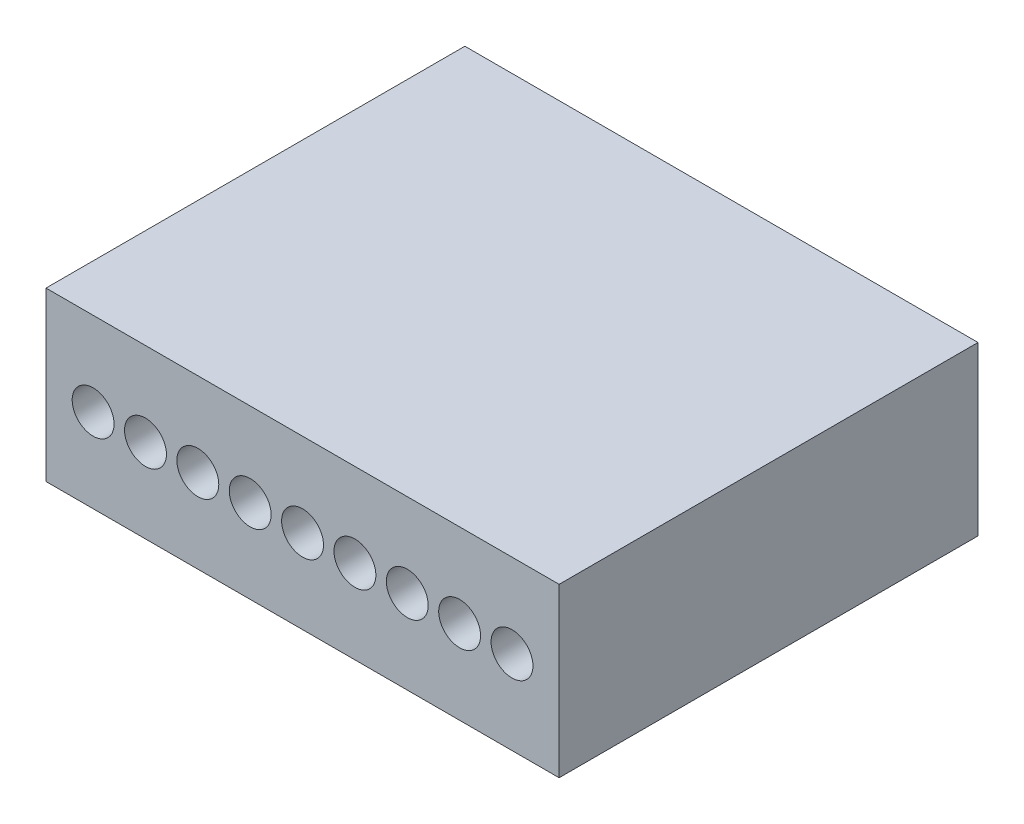
ISO-10303-21;
HEADER;
FILE_DESCRIPTION(('STEP AP214'),'2;1');
FILE_NAME('part.step','',(''),(''),'','','');
FILE_SCHEMA(('AUTOMOTIVE_DESIGN { 1 0 10303 214 1 1 1 1 }'));
ENDSEC;
DATA;
#1=APPLICATION_CONTEXT('core data for automotive mechanical design processes');
#2=APPLICATION_PROTOCOL_DEFINITION('international standard','automotive_design',2000,#1);
#3=PRODUCT_CONTEXT('',#1,'mechanical');
#4=PRODUCT('Part','Part','',(#3));
#5=PRODUCT_RELATED_PRODUCT_CATEGORY('part','',(#4));
#6=PRODUCT_DEFINITION_FORMATION('','',#4);
#7=PRODUCT_DEFINITION_CONTEXT('part definition',#1,'design');
#8=PRODUCT_DEFINITION('design','',#6,#7);
#9=PRODUCT_DEFINITION_SHAPE('','',#8);
#10=(LENGTH_UNIT() NAMED_UNIT(*) SI_UNIT(.MILLI.,.METRE.));
#11=(NAMED_UNIT(*) PLANE_ANGLE_UNIT() SI_UNIT($,.RADIAN.));
#12=(NAMED_UNIT(*) SI_UNIT($,.STERADIAN.) SOLID_ANGLE_UNIT());
#13=UNCERTAINTY_MEASURE_WITH_UNIT(LENGTH_MEASURE(1.E-05),#10,'distance_accuracy_value','');
#14=(GEOMETRIC_REPRESENTATION_CONTEXT(3) GLOBAL_UNCERTAINTY_ASSIGNED_CONTEXT((#13)) GLOBAL_UNIT_ASSIGNED_CONTEXT((#10,
#11,#12)) REPRESENTATION_CONTEXT('',''));
#15=CARTESIAN_POINT('',(0.,0.,0.));
#16=DIRECTION('',(0.,0.,1.));
#17=DIRECTION('',(1.,0.,0.));
#18=AXIS2_PLACEMENT_3D('',#15,#16,#17);
#19=CARTESIAN_POINT('',(0.,0.,10.));
#20=DIRECTION('',(1.,0.,0.));
#21=DIRECTION('',(0.,0.,-1.));
#22=AXIS2_PLACEMENT_3D('',#19,#20,#21);
#23=PLANE('',#22);
#24=DIRECTION('',(0.,-1.,0.));
#25=VECTOR('',#24,1.);
#26=CARTESIAN_POINT('',(0.,0.,0.));
#27=LINE('',#26,#25);
#28=CARTESIAN_POINT('',(0.,4.,0.));
#29=VERTEX_POINT('',#28);
#30=CARTESIAN_POINT('',(0.,0.,0.));
#31=VERTEX_POINT('',#30);
#32=EDGE_CURVE('E107',#29,#31,#27,.T.);
#33=ORIENTED_EDGE('',*,*,#32,.T.);
#34=DIRECTION('',(0.,0.,-1.));
#35=VECTOR('',#34,1.);
#36=CARTESIAN_POINT('',(0.,0.,10.));
#37=LINE('',#36,#35);
#38=CARTESIAN_POINT('',(0.,0.,10.));
#39=VERTEX_POINT('',#38);
#40=EDGE_CURVE('E11',#39,#31,#37,.T.);
#41=ORIENTED_EDGE('',*,*,#40,.F.);
#42=DIRECTION('',(0.,-1.,0.));
#43=VECTOR('',#42,1.);
#44=CARTESIAN_POINT('',(0.,0.,10.));
#45=LINE('',#44,#43);
#46=CARTESIAN_POINT('',(0.,4.,10.));
#47=VERTEX_POINT('',#46);
#48=EDGE_CURVE('E91',#47,#39,#45,.T.);
#49=ORIENTED_EDGE('',*,*,#48,.F.);
#50=DIRECTION('',(0.,0.,-1.));
#51=VECTOR('',#50,1.);
#52=CARTESIAN_POINT('',(0.,4.,10.));
#53=LINE('',#52,#51);
#54=EDGE_CURVE('E103',#47,#29,#53,.T.);
#55=ORIENTED_EDGE('',*,*,#54,.T.);
#56=EDGE_LOOP('',(#33,#41,#49,#55));
#57=FACE_BOUND('',#56,.T.);
#58=ADVANCED_FACE('F39',(#57),#23,.F.);
#59=CARTESIAN_POINT('',(0.,0.,10.));
#60=DIRECTION('',(0.,1.,0.));
#61=DIRECTION('',(0.,0.,1.));
#62=AXIS2_PLACEMENT_3D('',#59,#60,#61);
#63=PLANE('',#62);
#64=DIRECTION('',(1.,0.,0.));
#65=VECTOR('',#64,1.);
#66=CARTESIAN_POINT('',(0.,0.,0.));
#67=LINE('',#66,#65);
#68=CARTESIAN_POINT('',(12.25,0.,0.));
#69=VERTEX_POINT('',#68);
#70=EDGE_CURVE('E96',#31,#69,#67,.T.);
#71=ORIENTED_EDGE('',*,*,#70,.T.);
#72=DIRECTION('',(0.,0.,-1.));
#73=VECTOR('',#72,1.);
#74=CARTESIAN_POINT('',(12.25,0.,10.));
#75=LINE('',#74,#73);
#76=CARTESIAN_POINT('',(12.25,0.,10.));
#77=VERTEX_POINT('',#76);
#78=EDGE_CURVE('E48',#77,#69,#75,.T.);
#79=ORIENTED_EDGE('',*,*,#78,.F.);
#80=DIRECTION('',(1.,0.,0.));
#81=VECTOR('',#80,1.);
#82=CARTESIAN_POINT('',(0.,0.,10.));
#83=LINE('',#82,#81);
#84=EDGE_CURVE('E86',#39,#77,#83,.T.);
#85=ORIENTED_EDGE('',*,*,#84,.F.);
#86=ORIENTED_EDGE('',*,*,#40,.T.);
#87=EDGE_LOOP('',(#71,#79,#85,#86));
#88=FACE_BOUND('',#87,.T.);
#89=ADVANCED_FACE('F95',(#88),#63,.F.);
#90=CARTESIAN_POINT('',(12.25,0.,10.));
#91=DIRECTION('',(-1.,0.,0.));
#92=DIRECTION('',(0.,0.,1.));
#93=AXIS2_PLACEMENT_3D('',#90,#91,#92);
#94=PLANE('',#93);
#95=DIRECTION('',(0.,1.,0.));
#96=VECTOR('',#95,1.);
#97=CARTESIAN_POINT('',(12.25,0.,0.));
#98=LINE('',#97,#96);
#99=CARTESIAN_POINT('',(12.25,4.,0.));
#100=VERTEX_POINT('',#99);
#101=EDGE_CURVE('E73',#69,#100,#98,.T.);
#102=ORIENTED_EDGE('',*,*,#101,.T.);
#103=DIRECTION('',(0.,0.,-1.));
#104=VECTOR('',#103,1.);
#105=CARTESIAN_POINT('',(12.25,4.,10.));
#106=LINE('',#105,#104);
#107=CARTESIAN_POINT('',(12.25,4.,10.));
#108=VERTEX_POINT('',#107);
#109=EDGE_CURVE('E98',#108,#100,#106,.T.);
#110=ORIENTED_EDGE('',*,*,#109,.F.);
#111=DIRECTION('',(0.,1.,0.));
#112=VECTOR('',#111,1.);
#113=CARTESIAN_POINT('',(12.25,0.,10.));
#114=LINE('',#113,#112);
#115=EDGE_CURVE('E89',#77,#108,#114,.T.);
#116=ORIENTED_EDGE('',*,*,#115,.F.);
#117=ORIENTED_EDGE('',*,*,#78,.T.);
#118=EDGE_LOOP('',(#102,#110,#116,#117));
#119=FACE_BOUND('',#118,.T.);
#120=ADVANCED_FACE('F99',(#119),#94,.F.);
#121=CARTESIAN_POINT('',(0.,4.,10.));
#122=DIRECTION('',(0.,-1.,0.));
#123=DIRECTION('',(0.,0.,-1.));
#124=AXIS2_PLACEMENT_3D('',#121,#122,#123);
#125=PLANE('',#124);
#126=DIRECTION('',(-1.,0.,0.));
#127=VECTOR('',#126,1.);
#128=CARTESIAN_POINT('',(0.,4.,0.));
#129=LINE('',#128,#127);
#130=EDGE_CURVE('E79',#100,#29,#129,.T.);
#131=ORIENTED_EDGE('',*,*,#130,.T.);
#132=ORIENTED_EDGE('',*,*,#54,.F.);
#133=DIRECTION('',(-1.,0.,0.));
#134=VECTOR('',#133,1.);
#135=CARTESIAN_POINT('',(0.,4.,10.));
#136=LINE('',#135,#134);
#137=EDGE_CURVE('E56',#108,#47,#136,.T.);
#138=ORIENTED_EDGE('',*,*,#137,.F.);
#139=ORIENTED_EDGE('',*,*,#109,.T.);
#140=EDGE_LOOP('',(#131,#132,#138,#139));
#141=FACE_BOUND('',#140,.T.);
#142=ADVANCED_FACE('F121',(#141),#125,.F.);
#143=CARTESIAN_POINT('',(0.,0.,10.));
#144=DIRECTION('',(0.,0.,-1.));
#145=DIRECTION('',(-1.,0.,0.));
#146=AXIS2_PLACEMENT_3D('',#143,#144,#145);
#147=PLANE('',#146);
#148=CARTESIAN_POINT('',(1.125,2.,10.));
#149=DIRECTION('',(0.,0.,1.));
#150=DIRECTION('',(1.,0.,0.));
#151=AXIS2_PLACEMENT_3D('',#148,#149,#150);
#152=CIRCLE('',#151,0.5);
#153=CARTESIAN_POINT('',(1.625,2.,10.));
#154=VERTEX_POINT('',#153);
#155=EDGE_CURVE('E192',#154,#154,#152,.T.);
#156=ORIENTED_EDGE('',*,*,#155,.F.);
#157=EDGE_LOOP('',(#156));
#158=FACE_BOUND('',#157,.T.);
#159=CARTESIAN_POINT('',(2.375,2.,10.));
#160=DIRECTION('',(0.,0.,1.));
#161=DIRECTION('',(1.,0.,0.));
#162=AXIS2_PLACEMENT_3D('',#159,#160,#161);
#163=CIRCLE('',#162,0.5);
#164=CARTESIAN_POINT('',(2.875,2.,10.));
#165=VERTEX_POINT('',#164);
#166=EDGE_CURVE('E184',#165,#165,#163,.T.);
#167=ORIENTED_EDGE('',*,*,#166,.F.);
#168=EDGE_LOOP('',(#167));
#169=FACE_BOUND('',#168,.T.);
#170=CARTESIAN_POINT('',(3.625,2.,10.));
#171=DIRECTION('',(0.,0.,1.));
#172=DIRECTION('',(1.,0.,0.));
#173=AXIS2_PLACEMENT_3D('',#170,#171,#172);
#174=CIRCLE('',#173,0.5);
#175=CARTESIAN_POINT('',(4.125,2.,10.));
#176=VERTEX_POINT('',#175);
#177=EDGE_CURVE('E176',#176,#176,#174,.T.);
#178=ORIENTED_EDGE('',*,*,#177,.F.);
#179=EDGE_LOOP('',(#178));
#180=FACE_BOUND('',#179,.T.);
#181=CARTESIAN_POINT('',(4.875,2.,10.));
#182=DIRECTION('',(0.,0.,1.));
#183=DIRECTION('',(1.,0.,0.));
#184=AXIS2_PLACEMENT_3D('',#181,#182,#183);
#185=CIRCLE('',#184,0.5);
#186=CARTESIAN_POINT('',(5.375,2.,10.));
#187=VERTEX_POINT('',#186);
#188=EDGE_CURVE('E168',#187,#187,#185,.T.);
#189=ORIENTED_EDGE('',*,*,#188,.F.);
#190=EDGE_LOOP('',(#189));
#191=FACE_BOUND('',#190,.T.);
#192=CARTESIAN_POINT('',(6.125,2.,10.));
#193=DIRECTION('',(0.,0.,1.));
#194=DIRECTION('',(1.,0.,0.));
#195=AXIS2_PLACEMENT_3D('',#192,#193,#194);
#196=CIRCLE('',#195,0.5);
#197=CARTESIAN_POINT('',(6.625,2.,10.));
#198=VERTEX_POINT('',#197);
#199=EDGE_CURVE('E160',#198,#198,#196,.T.);
#200=ORIENTED_EDGE('',*,*,#199,.F.);
#201=EDGE_LOOP('',(#200));
#202=FACE_BOUND('',#201,.T.);
#203=CARTESIAN_POINT('',(7.375,2.,10.));
#204=DIRECTION('',(0.,0.,1.));
#205=DIRECTION('',(1.,0.,0.));
#206=AXIS2_PLACEMENT_3D('',#203,#204,#205);
#207=CIRCLE('',#206,0.500000000000002);
#208=CARTESIAN_POINT('',(7.875,2.,10.));
#209=VERTEX_POINT('',#208);
#210=EDGE_CURVE('E152',#209,#209,#207,.T.);
#211=ORIENTED_EDGE('',*,*,#210,.F.);
#212=EDGE_LOOP('',(#211));
#213=FACE_BOUND('',#212,.T.);
#214=CARTESIAN_POINT('',(8.625,2.,10.));
#215=DIRECTION('',(0.,0.,1.));
#216=DIRECTION('',(1.,0.,0.));
#217=AXIS2_PLACEMENT_3D('',#214,#215,#216);
#218=CIRCLE('',#217,0.499999999999999);
#219=CARTESIAN_POINT('',(9.125,2.,10.));
#220=VERTEX_POINT('',#219);
#221=EDGE_CURVE('E144',#220,#220,#218,.T.);
#222=ORIENTED_EDGE('',*,*,#221,.F.);
#223=EDGE_LOOP('',(#222));
#224=FACE_BOUND('',#223,.T.);
#225=CARTESIAN_POINT('',(9.875,2.,10.));
#226=DIRECTION('',(0.,0.,1.));
#227=DIRECTION('',(1.,0.,0.));
#228=AXIS2_PLACEMENT_3D('',#225,#226,#227);
#229=CIRCLE('',#228,0.499999999999999);
#230=CARTESIAN_POINT('',(10.375,2.,10.));
#231=VERTEX_POINT('',#230);
#232=EDGE_CURVE('E136',#231,#231,#229,.T.);
#233=ORIENTED_EDGE('',*,*,#232,.F.);
#234=EDGE_LOOP('',(#233));
#235=FACE_BOUND('',#234,.T.);
#236=CARTESIAN_POINT('',(11.125,2.,10.));
#237=DIRECTION('',(0.,0.,1.));
#238=DIRECTION('',(1.,0.,0.));
#239=AXIS2_PLACEMENT_3D('',#236,#237,#238);
#240=CIRCLE('',#239,0.499999999999999);
#241=CARTESIAN_POINT('',(11.625,2.,10.));
#242=VERTEX_POINT('',#241);
#243=EDGE_CURVE('E128',#242,#242,#240,.T.);
#244=ORIENTED_EDGE('',*,*,#243,.F.);
#245=EDGE_LOOP('',(#244));
#246=FACE_BOUND('',#245,.T.);
#247=ORIENTED_EDGE('',*,*,#48,.T.);
#248=ORIENTED_EDGE('',*,*,#84,.T.);
#249=ORIENTED_EDGE('',*,*,#115,.T.);
#250=ORIENTED_EDGE('',*,*,#137,.T.);
#251=EDGE_LOOP('',(#247,#248,#249,#250));
#252=FACE_BOUND('',#251,.T.);
#253=ADVANCED_FACE('F87',(#158,#169,#180,#191,#202,#213,#224,#235,#246,#252),#147,.F.);
#254=CARTESIAN_POINT('',(0.,0.,0.));
#255=DIRECTION('',(0.,0.,-1.));
#256=DIRECTION('',(-1.,0.,0.));
#257=AXIS2_PLACEMENT_3D('',#254,#255,#256);
#258=PLANE('',#257);
#259=ORIENTED_EDGE('',*,*,#32,.F.);
#260=ORIENTED_EDGE('',*,*,#130,.F.);
#261=ORIENTED_EDGE('',*,*,#101,.F.);
#262=ORIENTED_EDGE('',*,*,#70,.F.);
#263=EDGE_LOOP('',(#259,#260,#261,#262));
#264=FACE_BOUND('',#263,.T.);
#265=ADVANCED_FACE('F124',(#264),#258,.T.);
#266=CARTESIAN_POINT('',(11.125,2.,5.));
#267=DIRECTION('',(0.,0.,1.));
#268=DIRECTION('',(1.,0.,0.));
#269=AXIS2_PLACEMENT_3D('',#266,#267,#268);
#270=CYLINDRICAL_SURFACE('',#269,0.499999999999999);
#271=CARTESIAN_POINT('',(11.125,2.,5.));
#272=DIRECTION('',(0.,0.,1.));
#273=DIRECTION('',(1.,0.,0.));
#274=AXIS2_PLACEMENT_3D('',#271,#272,#273);
#275=CIRCLE('',#274,0.499999999999999);
#276=CARTESIAN_POINT('',(11.625,2.,5.));
#277=VERTEX_POINT('',#276);
#278=EDGE_CURVE('E132',#277,#277,#275,.T.);
#279=ORIENTED_EDGE('',*,*,#278,.F.);
#280=EDGE_LOOP('',(#279));
#281=FACE_BOUND('',#280,.T.);
#282=ORIENTED_EDGE('',*,*,#243,.T.);
#283=EDGE_LOOP('',(#282));
#284=FACE_BOUND('',#283,.T.);
#285=ADVANCED_FACE('F228',(#281,#284),#270,.F.);
#286=CARTESIAN_POINT('',(11.125,2.,5.));
#287=DIRECTION('',(0.,0.,1.));
#288=DIRECTION('',(1.,0.,0.));
#289=AXIS2_PLACEMENT_3D('',#286,#287,#288);
#290=PLANE('',#289);
#291=ORIENTED_EDGE('',*,*,#278,.T.);
#292=EDGE_LOOP('',(#291));
#293=FACE_BOUND('',#292,.T.);
#294=ADVANCED_FACE('F230',(#293),#290,.T.);
#295=CARTESIAN_POINT('',(9.875,2.,5.));
#296=DIRECTION('',(0.,0.,1.));
#297=DIRECTION('',(1.,0.,0.));
#298=AXIS2_PLACEMENT_3D('',#295,#296,#297);
#299=CYLINDRICAL_SURFACE('',#298,0.499999999999999);
#300=CARTESIAN_POINT('',(9.875,2.,5.));
#301=DIRECTION('',(0.,0.,1.));
#302=DIRECTION('',(1.,0.,0.));
#303=AXIS2_PLACEMENT_3D('',#300,#301,#302);
#304=CIRCLE('',#303,0.499999999999999);
#305=CARTESIAN_POINT('',(10.375,2.,5.));
#306=VERTEX_POINT('',#305);
#307=EDGE_CURVE('E140',#306,#306,#304,.T.);
#308=ORIENTED_EDGE('',*,*,#307,.F.);
#309=EDGE_LOOP('',(#308));
#310=FACE_BOUND('',#309,.T.);
#311=ORIENTED_EDGE('',*,*,#232,.T.);
#312=EDGE_LOOP('',(#311));
#313=FACE_BOUND('',#312,.T.);
#314=ADVANCED_FACE('F237',(#310,#313),#299,.F.);
#315=CARTESIAN_POINT('',(9.875,2.,5.));
#316=DIRECTION('',(0.,0.,1.));
#317=DIRECTION('',(1.,0.,0.));
#318=AXIS2_PLACEMENT_3D('',#315,#316,#317);
#319=PLANE('',#318);
#320=ORIENTED_EDGE('',*,*,#307,.T.);
#321=EDGE_LOOP('',(#320));
#322=FACE_BOUND('',#321,.T.);
#323=ADVANCED_FACE('F285',(#322),#319,.T.);
#324=CARTESIAN_POINT('',(8.625,2.,5.));
#325=DIRECTION('',(0.,0.,1.));
#326=DIRECTION('',(1.,0.,0.));
#327=AXIS2_PLACEMENT_3D('',#324,#325,#326);
#328=CYLINDRICAL_SURFACE('',#327,0.499999999999999);
#329=CARTESIAN_POINT('',(8.625,2.,5.));
#330=DIRECTION('',(0.,0.,1.));
#331=DIRECTION('',(1.,0.,0.));
#332=AXIS2_PLACEMENT_3D('',#329,#330,#331);
#333=CIRCLE('',#332,0.499999999999999);
#334=CARTESIAN_POINT('',(9.125,2.,5.));
#335=VERTEX_POINT('',#334);
#336=EDGE_CURVE('E148',#335,#335,#333,.T.);
#337=ORIENTED_EDGE('',*,*,#336,.F.);
#338=EDGE_LOOP('',(#337));
#339=FACE_BOUND('',#338,.T.);
#340=ORIENTED_EDGE('',*,*,#221,.T.);
#341=EDGE_LOOP('',(#340));
#342=FACE_BOUND('',#341,.T.);
#343=ADVANCED_FACE('F294',(#339,#342),#328,.F.);
#344=CARTESIAN_POINT('',(8.625,2.,5.));
#345=DIRECTION('',(0.,0.,1.));
#346=DIRECTION('',(1.,0.,0.));
#347=AXIS2_PLACEMENT_3D('',#344,#345,#346);
#348=PLANE('',#347);
#349=ORIENTED_EDGE('',*,*,#336,.T.);
#350=EDGE_LOOP('',(#349));
#351=FACE_BOUND('',#350,.T.);
#352=ADVANCED_FACE('F303',(#351),#348,.T.);
#353=CARTESIAN_POINT('',(7.375,2.,5.));
#354=DIRECTION('',(0.,0.,1.));
#355=DIRECTION('',(1.,0.,0.));
#356=AXIS2_PLACEMENT_3D('',#353,#354,#355);
#357=CYLINDRICAL_SURFACE('',#356,0.500000000000002);
#358=CARTESIAN_POINT('',(7.375,2.,5.));
#359=DIRECTION('',(0.,0.,1.));
#360=DIRECTION('',(1.,0.,0.));
#361=AXIS2_PLACEMENT_3D('',#358,#359,#360);
#362=CIRCLE('',#361,0.500000000000002);
#363=CARTESIAN_POINT('',(7.875,2.,5.));
#364=VERTEX_POINT('',#363);
#365=EDGE_CURVE('E156',#364,#364,#362,.T.);
#366=ORIENTED_EDGE('',*,*,#365,.F.);
#367=EDGE_LOOP('',(#366));
#368=FACE_BOUND('',#367,.T.);
#369=ORIENTED_EDGE('',*,*,#210,.T.);
#370=EDGE_LOOP('',(#369));
#371=FACE_BOUND('',#370,.T.);
#372=ADVANCED_FACE('F312',(#368,#371),#357,.F.);
#373=CARTESIAN_POINT('',(7.375,2.,5.));
#374=DIRECTION('',(0.,0.,1.));
#375=DIRECTION('',(1.,0.,0.));
#376=AXIS2_PLACEMENT_3D('',#373,#374,#375);
#377=PLANE('',#376);
#378=ORIENTED_EDGE('',*,*,#365,.T.);
#379=EDGE_LOOP('',(#378));
#380=FACE_BOUND('',#379,.T.);
#381=ADVANCED_FACE('F321',(#380),#377,.T.);
#382=CARTESIAN_POINT('',(6.125,2.,5.));
#383=DIRECTION('',(0.,0.,1.));
#384=DIRECTION('',(1.,0.,0.));
#385=AXIS2_PLACEMENT_3D('',#382,#383,#384);
#386=CYLINDRICAL_SURFACE('',#385,0.5);
#387=CARTESIAN_POINT('',(6.125,2.,5.));
#388=DIRECTION('',(0.,0.,1.));
#389=DIRECTION('',(1.,0.,0.));
#390=AXIS2_PLACEMENT_3D('',#387,#388,#389);
#391=CIRCLE('',#390,0.5);
#392=CARTESIAN_POINT('',(6.625,2.,5.));
#393=VERTEX_POINT('',#392);
#394=EDGE_CURVE('E164',#393,#393,#391,.T.);
#395=ORIENTED_EDGE('',*,*,#394,.F.);
#396=EDGE_LOOP('',(#395));
#397=FACE_BOUND('',#396,.T.);
#398=ORIENTED_EDGE('',*,*,#199,.T.);
#399=EDGE_LOOP('',(#398));
#400=FACE_BOUND('',#399,.T.);
#401=ADVANCED_FACE('F330',(#397,#400),#386,.F.);
#402=CARTESIAN_POINT('',(6.125,2.,5.));
#403=DIRECTION('',(0.,0.,1.));
#404=DIRECTION('',(1.,0.,0.));
#405=AXIS2_PLACEMENT_3D('',#402,#403,#404);
#406=PLANE('',#405);
#407=ORIENTED_EDGE('',*,*,#394,.T.);
#408=EDGE_LOOP('',(#407));
#409=FACE_BOUND('',#408,.T.);
#410=ADVANCED_FACE('F339',(#409),#406,.T.);
#411=CARTESIAN_POINT('',(4.875,2.,5.));
#412=DIRECTION('',(0.,0.,1.));
#413=DIRECTION('',(1.,0.,0.));
#414=AXIS2_PLACEMENT_3D('',#411,#412,#413);
#415=CYLINDRICAL_SURFACE('',#414,0.5);
#416=CARTESIAN_POINT('',(4.875,2.,5.));
#417=DIRECTION('',(0.,0.,1.));
#418=DIRECTION('',(1.,0.,0.));
#419=AXIS2_PLACEMENT_3D('',#416,#417,#418);
#420=CIRCLE('',#419,0.5);
#421=CARTESIAN_POINT('',(5.375,2.,5.));
#422=VERTEX_POINT('',#421);
#423=EDGE_CURVE('E172',#422,#422,#420,.T.);
#424=ORIENTED_EDGE('',*,*,#423,.F.);
#425=EDGE_LOOP('',(#424));
#426=FACE_BOUND('',#425,.T.);
#427=ORIENTED_EDGE('',*,*,#188,.T.);
#428=EDGE_LOOP('',(#427));
#429=FACE_BOUND('',#428,.T.);
#430=ADVANCED_FACE('F348',(#426,#429),#415,.F.);
#431=CARTESIAN_POINT('',(4.875,2.,5.));
#432=DIRECTION('',(0.,0.,1.));
#433=DIRECTION('',(1.,0.,0.));
#434=AXIS2_PLACEMENT_3D('',#431,#432,#433);
#435=PLANE('',#434);
#436=ORIENTED_EDGE('',*,*,#423,.T.);
#437=EDGE_LOOP('',(#436));
#438=FACE_BOUND('',#437,.T.);
#439=ADVANCED_FACE('F357',(#438),#435,.T.);
#440=CARTESIAN_POINT('',(3.625,2.,5.));
#441=DIRECTION('',(0.,0.,1.));
#442=DIRECTION('',(1.,0.,0.));
#443=AXIS2_PLACEMENT_3D('',#440,#441,#442);
#444=CYLINDRICAL_SURFACE('',#443,0.5);
#445=CARTESIAN_POINT('',(3.625,2.,5.));
#446=DIRECTION('',(0.,0.,1.));
#447=DIRECTION('',(1.,0.,0.));
#448=AXIS2_PLACEMENT_3D('',#445,#446,#447);
#449=CIRCLE('',#448,0.5);
#450=CARTESIAN_POINT('',(4.125,2.,5.));
#451=VERTEX_POINT('',#450);
#452=EDGE_CURVE('E180',#451,#451,#449,.T.);
#453=ORIENTED_EDGE('',*,*,#452,.F.);
#454=EDGE_LOOP('',(#453));
#455=FACE_BOUND('',#454,.T.);
#456=ORIENTED_EDGE('',*,*,#177,.T.);
#457=EDGE_LOOP('',(#456));
#458=FACE_BOUND('',#457,.T.);
#459=ADVANCED_FACE('F366',(#455,#458),#444,.F.);
#460=CARTESIAN_POINT('',(3.625,2.,5.));
#461=DIRECTION('',(0.,0.,1.));
#462=DIRECTION('',(1.,0.,0.));
#463=AXIS2_PLACEMENT_3D('',#460,#461,#462);
#464=PLANE('',#463);
#465=ORIENTED_EDGE('',*,*,#452,.T.);
#466=EDGE_LOOP('',(#465));
#467=FACE_BOUND('',#466,.T.);
#468=ADVANCED_FACE('F375',(#467),#464,.T.);
#469=CARTESIAN_POINT('',(2.375,2.,5.));
#470=DIRECTION('',(0.,0.,1.));
#471=DIRECTION('',(1.,0.,0.));
#472=AXIS2_PLACEMENT_3D('',#469,#470,#471);
#473=CYLINDRICAL_SURFACE('',#472,0.5);
#474=CARTESIAN_POINT('',(2.375,2.,5.));
#475=DIRECTION('',(0.,0.,1.));
#476=DIRECTION('',(1.,0.,0.));
#477=AXIS2_PLACEMENT_3D('',#474,#475,#476);
#478=CIRCLE('',#477,0.5);
#479=CARTESIAN_POINT('',(2.875,2.,5.));
#480=VERTEX_POINT('',#479);
#481=EDGE_CURVE('E188',#480,#480,#478,.T.);
#482=ORIENTED_EDGE('',*,*,#481,.F.);
#483=EDGE_LOOP('',(#482));
#484=FACE_BOUND('',#483,.T.);
#485=ORIENTED_EDGE('',*,*,#166,.T.);
#486=EDGE_LOOP('',(#485));
#487=FACE_BOUND('',#486,.T.);
#488=ADVANCED_FACE('F384',(#484,#487),#473,.F.);
#489=CARTESIAN_POINT('',(2.375,2.,5.));
#490=DIRECTION('',(0.,0.,1.));
#491=DIRECTION('',(1.,0.,0.));
#492=AXIS2_PLACEMENT_3D('',#489,#490,#491);
#493=PLANE('',#492);
#494=ORIENTED_EDGE('',*,*,#481,.T.);
#495=EDGE_LOOP('',(#494));
#496=FACE_BOUND('',#495,.T.);
#497=ADVANCED_FACE('F205',(#496),#493,.T.);
#498=CARTESIAN_POINT('',(1.125,2.,5.));
#499=DIRECTION('',(0.,0.,1.));
#500=DIRECTION('',(1.,0.,0.));
#501=AXIS2_PLACEMENT_3D('',#498,#499,#500);
#502=CYLINDRICAL_SURFACE('',#501,0.5);
#503=CARTESIAN_POINT('',(1.125,2.,5.));
#504=DIRECTION('',(0.,0.,1.));
#505=DIRECTION('',(1.,0.,0.));
#506=AXIS2_PLACEMENT_3D('',#503,#504,#505);
#507=CIRCLE('',#506,0.5);
#508=CARTESIAN_POINT('',(1.625,2.,5.));
#509=VERTEX_POINT('',#508);
#510=EDGE_CURVE('E111',#509,#509,#507,.T.);
#511=ORIENTED_EDGE('',*,*,#510,.F.);
#512=EDGE_LOOP('',(#511));
#513=FACE_BOUND('',#512,.T.);
#514=ORIENTED_EDGE('',*,*,#155,.T.);
#515=EDGE_LOOP('',(#514));
#516=FACE_BOUND('',#515,.T.);
#517=ADVANCED_FACE('F202',(#513,#516),#502,.F.);
#518=CARTESIAN_POINT('',(1.125,2.,5.));
#519=DIRECTION('',(0.,0.,1.));
#520=DIRECTION('',(1.,0.,0.));
#521=AXIS2_PLACEMENT_3D('',#518,#519,#520);
#522=PLANE('',#521);
#523=ORIENTED_EDGE('',*,*,#510,.T.);
#524=EDGE_LOOP('',(#523));
#525=FACE_BOUND('',#524,.T.);
#526=ADVANCED_FACE('F200',(#525),#522,.T.);
#527=CLOSED_SHELL('',(#58,#89,#120,#142,#253,#265,#285,#294,#314,#323,#343,#352,#372,#381,#401,
#410,#430,#439,#459,#468,#488,#497,#517,#526));
#528=MANIFOLD_SOLID_BREP('B2',#527);
#529=ADVANCED_BREP_SHAPE_REPRESENTATION('',(#18,#528),#14);
#530=SHAPE_DEFINITION_REPRESENTATION(#9,#529);
ENDSEC;
END-ISO-10303-21;
